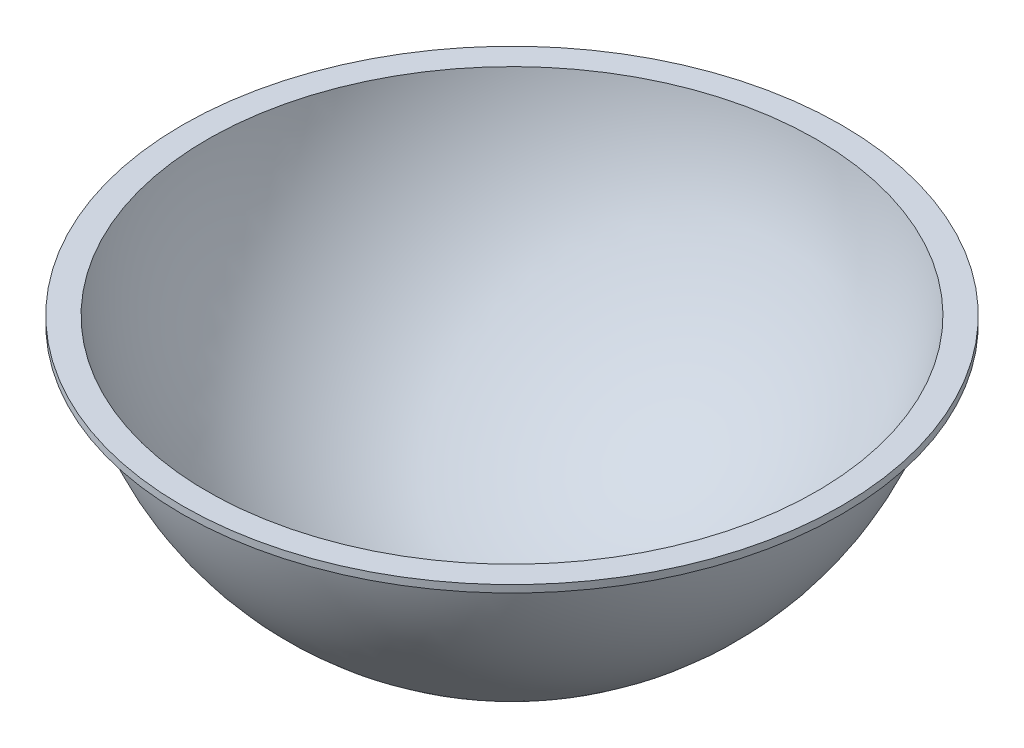
ISO-10303-21;
HEADER;
FILE_DESCRIPTION(('STEP AP214'),'2;1');
FILE_NAME('part.step','',(''),(''),'','','');
FILE_SCHEMA(('AUTOMOTIVE_DESIGN { 1 0 10303 214 1 1 1 1 }'));
ENDSEC;
DATA;
#1=APPLICATION_CONTEXT('core data for automotive mechanical design processes');
#2=APPLICATION_PROTOCOL_DEFINITION('international standard','automotive_design',2000,#1);
#3=PRODUCT_CONTEXT('',#1,'mechanical');
#4=PRODUCT('Part','Part','',(#3));
#5=PRODUCT_RELATED_PRODUCT_CATEGORY('part','',(#4));
#6=PRODUCT_DEFINITION_FORMATION('','',#4);
#7=PRODUCT_DEFINITION_CONTEXT('part definition',#1,'design');
#8=PRODUCT_DEFINITION('design','',#6,#7);
#9=PRODUCT_DEFINITION_SHAPE('','',#8);
#10=(LENGTH_UNIT() NAMED_UNIT(*) SI_UNIT(.MILLI.,.METRE.));
#11=(NAMED_UNIT(*) PLANE_ANGLE_UNIT() SI_UNIT($,.RADIAN.));
#12=(NAMED_UNIT(*) SI_UNIT($,.STERADIAN.) SOLID_ANGLE_UNIT());
#13=UNCERTAINTY_MEASURE_WITH_UNIT(LENGTH_MEASURE(1.E-05),#10,'distance_accuracy_value','');
#14=(GEOMETRIC_REPRESENTATION_CONTEXT(3) GLOBAL_UNCERTAINTY_ASSIGNED_CONTEXT((#13)) GLOBAL_UNIT_ASSIGNED_CONTEXT((#10,
#11,#12)) REPRESENTATION_CONTEXT('',''));
#15=CARTESIAN_POINT('',(0.,0.,0.));
#16=DIRECTION('',(0.,0.,1.));
#17=DIRECTION('',(1.,0.,0.));
#18=AXIS2_PLACEMENT_3D('',#15,#16,#17);
#19=CARTESIAN_POINT('',(0.,109.991071428571,0.));
#20=DIRECTION('',(0.,-1.,0.));
#21=DIRECTION('',(0.,0.,1.));
#22=AXIS2_PLACEMENT_3D('',#19,#20,#21);
#23=SPHERICAL_SURFACE('',#22,109.991071428571);
#24=CARTESIAN_POINT('',(0.,88.9,0.));
#25=DIRECTION('',(0.,-1.,0.));
#26=DIRECTION('',(0.,0.,-1.));
#27=AXIS2_PLACEMENT_3D('',#24,#25,#26);
#28=CIRCLE('',#27,107.95);
#29=CARTESIAN_POINT('',(0.,88.9,-107.95));
#30=VERTEX_POINT('',#29);
#31=EDGE_CURVE('E10',#30,#30,#28,.T.);
#32=ORIENTED_EDGE('',*,*,#31,.T.);
#33=EDGE_LOOP('',(#32));
#34=FACE_BOUND('',#33,.T.);
#35=ADVANCED_FACE('F30',(#34),#23,.T.);
#36=CARTESIAN_POINT('',(0.,88.9,-107.95));
#37=DIRECTION('',(0.,-1.,0.));
#38=DIRECTION('',(0.,0.,-1.));
#39=AXIS2_PLACEMENT_3D('',#36,#37,#38);
#40=PLANE('',#39);
#41=CARTESIAN_POINT('',(0.,88.9,0.));
#42=DIRECTION('',(0.,-1.,0.));
#43=DIRECTION('',(0.,0.,-1.));
#44=AXIS2_PLACEMENT_3D('',#41,#42,#43);
#45=CIRCLE('',#44,114.504378868146);
#46=CARTESIAN_POINT('',(0.,88.9,-114.504378868146));
#47=VERTEX_POINT('',#46);
#48=EDGE_CURVE('E36',#47,#47,#45,.T.);
#49=ORIENTED_EDGE('',*,*,#48,.T.);
#50=EDGE_LOOP('',(#49));
#51=FACE_BOUND('',#50,.T.);
#52=ORIENTED_EDGE('',*,*,#31,.F.);
#53=EDGE_LOOP('',(#52));
#54=FACE_BOUND('',#53,.T.);
#55=ADVANCED_FACE('F62',(#51,#54),#40,.T.);
#56=CARTESIAN_POINT('',(0.,0.,0.));
#57=DIRECTION('',(0.,-1.,0.));
#58=DIRECTION('',(0.,0.,-1.));
#59=AXIS2_PLACEMENT_3D('',#56,#57,#58);
#60=CYLINDRICAL_SURFACE('',#59,114.504378868146);
#61=CARTESIAN_POINT('',(0.,91.44,0.));
#62=DIRECTION('',(0.,-1.,0.));
#63=DIRECTION('',(0.,0.,-1.));
#64=AXIS2_PLACEMENT_3D('',#61,#62,#63);
#65=CIRCLE('',#64,114.504378868146);
#66=CARTESIAN_POINT('',(0.,91.44,-114.504378868146));
#67=VERTEX_POINT('',#66);
#68=EDGE_CURVE('E40',#67,#67,#65,.T.);
#69=ORIENTED_EDGE('',*,*,#68,.T.);
#70=EDGE_LOOP('',(#69));
#71=FACE_BOUND('',#70,.T.);
#72=ORIENTED_EDGE('',*,*,#48,.F.);
#73=EDGE_LOOP('',(#72));
#74=FACE_BOUND('',#73,.T.);
#75=ADVANCED_FACE('F59',(#71,#74),#60,.T.);
#76=CARTESIAN_POINT('',(0.,91.44,-105.837566582003));
#77=DIRECTION('',(0.,1.,0.));
#78=DIRECTION('',(0.,0.,1.));
#79=AXIS2_PLACEMENT_3D('',#76,#77,#78);
#80=PLANE('',#79);
#81=CARTESIAN_POINT('',(0.,91.44,0.));
#82=DIRECTION('',(0.,-1.,0.));
#83=DIRECTION('',(0.,0.,-1.));
#84=AXIS2_PLACEMENT_3D('',#81,#82,#83);
#85=CIRCLE('',#84,105.837566582003);
#86=CARTESIAN_POINT('',(0.,91.44,-105.837566582003));
#87=VERTEX_POINT('',#86);
#88=EDGE_CURVE('E44',#87,#87,#85,.T.);
#89=ORIENTED_EDGE('',*,*,#88,.T.);
#90=EDGE_LOOP('',(#89));
#91=FACE_BOUND('',#90,.T.);
#92=ORIENTED_EDGE('',*,*,#68,.F.);
#93=EDGE_LOOP('',(#92));
#94=FACE_BOUND('',#93,.T.);
#95=ADVANCED_FACE('F50',(#91,#94),#80,.T.);
#96=CARTESIAN_POINT('',(0.,109.991071428571,0.));
#97=DIRECTION('',(0.,-1.,0.));
#98=DIRECTION('',(0.,0.,-1.));
#99=AXIS2_PLACEMENT_3D('',#96,#97,#98);
#100=SPHERICAL_SURFACE('',#99,107.451071428571);
#101=ORIENTED_EDGE('',*,*,#88,.F.);
#102=EDGE_LOOP('',(#101));
#103=FACE_BOUND('',#102,.T.);
#104=ADVANCED_FACE('F53',(#103),#100,.F.);
#105=CLOSED_SHELL('',(#35,#55,#75,#95,#104));
#106=MANIFOLD_SOLID_BREP('B2',#105);
#107=ADVANCED_BREP_SHAPE_REPRESENTATION('',(#18,#106),#14);
#108=SHAPE_DEFINITION_REPRESENTATION(#9,#107);
ENDSEC;
END-ISO-10303-21;
